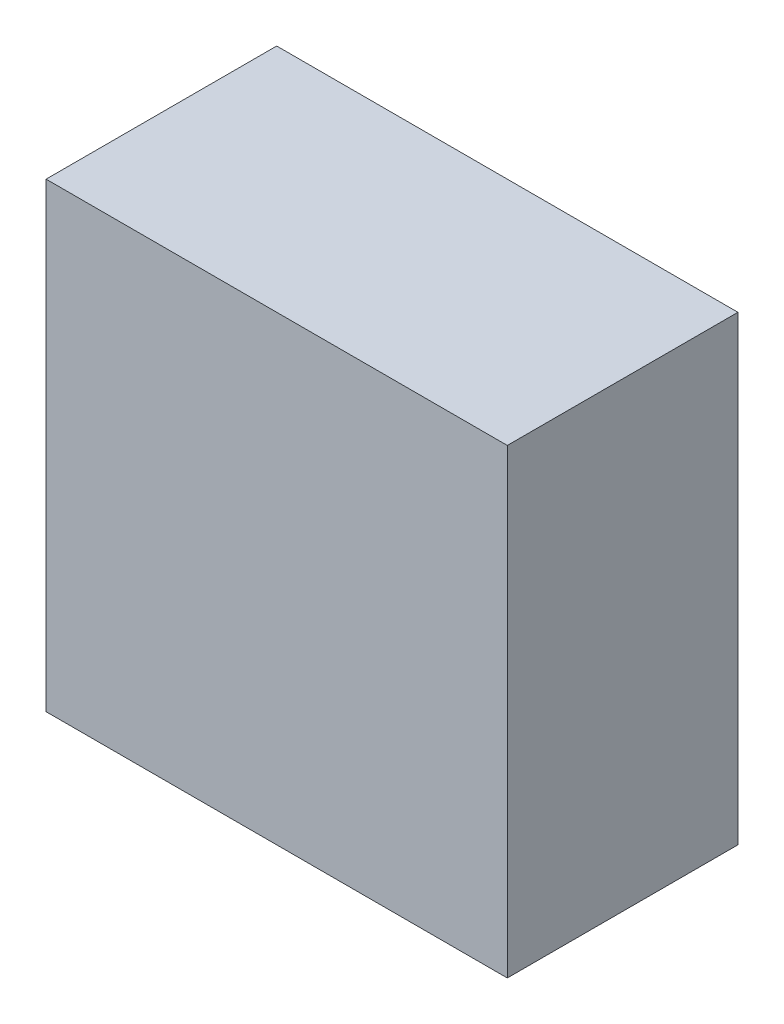
ISO-10303-21;
HEADER;
FILE_DESCRIPTION(('STEP AP214'),'2;1');
FILE_NAME('part.step','',(''),(''),'','','');
FILE_SCHEMA(('AUTOMOTIVE_DESIGN { 1 0 10303 214 1 1 1 1 }'));
ENDSEC;
DATA;
#1=APPLICATION_CONTEXT('core data for automotive mechanical design processes');
#2=APPLICATION_PROTOCOL_DEFINITION('international standard','automotive_design',2000,#1);
#3=PRODUCT_CONTEXT('',#1,'mechanical');
#4=PRODUCT('Part','Part','',(#3));
#5=PRODUCT_RELATED_PRODUCT_CATEGORY('part','',(#4));
#6=PRODUCT_DEFINITION_FORMATION('','',#4);
#7=PRODUCT_DEFINITION_CONTEXT('part definition',#1,'design');
#8=PRODUCT_DEFINITION('design','',#6,#7);
#9=PRODUCT_DEFINITION_SHAPE('','',#8);
#10=(LENGTH_UNIT() NAMED_UNIT(*) SI_UNIT(.MILLI.,.METRE.));
#11=(NAMED_UNIT(*) PLANE_ANGLE_UNIT() SI_UNIT($,.RADIAN.));
#12=(NAMED_UNIT(*) SI_UNIT($,.STERADIAN.) SOLID_ANGLE_UNIT());
#13=UNCERTAINTY_MEASURE_WITH_UNIT(LENGTH_MEASURE(1.E-05),#10,'distance_accuracy_value','');
#14=(GEOMETRIC_REPRESENTATION_CONTEXT(3) GLOBAL_UNCERTAINTY_ASSIGNED_CONTEXT((#13)) GLOBAL_UNIT_ASSIGNED_CONTEXT((#10,
#11,#12)) REPRESENTATION_CONTEXT('',''));
#15=CARTESIAN_POINT('',(0.,0.,0.));
#16=DIRECTION('',(0.,0.,1.));
#17=DIRECTION('',(1.,0.,0.));
#18=AXIS2_PLACEMENT_3D('',#15,#16,#17);
#19=CARTESIAN_POINT('',(0.,0.,2.75));
#20=DIRECTION('',(0.,0.,-1.));
#21=DIRECTION('',(-1.,0.,0.));
#22=AXIS2_PLACEMENT_3D('',#19,#20,#21);
#23=PLANE('',#22);
#24=DIRECTION('',(1.,0.,0.));
#25=VECTOR('',#24,1.);
#26=CARTESIAN_POINT('',(2.00000000000006,165.941489418563,2.75));
#27=LINE('',#26,#25);
#28=CARTESIAN_POINT('',(-1.99999999999995,165.941489418563,2.75));
#29=VERTEX_POINT('',#28);
#30=CARTESIAN_POINT('',(2.00000000000006,165.941489418563,2.75));
#31=VERTEX_POINT('',#30);
#32=EDGE_CURVE('E80',#29,#31,#27,.T.);
#33=ORIENTED_EDGE('',*,*,#32,.T.);
#34=DIRECTION('',(0.,1.,0.));
#35=VECTOR('',#34,1.);
#36=CARTESIAN_POINT('',(2.00000000000006,169.941489418563,2.75));
#37=LINE('',#36,#35);
#38=CARTESIAN_POINT('',(2.00000000000006,169.941489418563,2.75));
#39=VERTEX_POINT('',#38);
#40=EDGE_CURVE('E55',#31,#39,#37,.T.);
#41=ORIENTED_EDGE('',*,*,#40,.T.);
#42=DIRECTION('',(1.,0.,0.));
#43=VECTOR('',#42,1.);
#44=CARTESIAN_POINT('',(2.00000000000006,169.941489418563,2.75));
#45=LINE('',#44,#43);
#46=CARTESIAN_POINT('',(-1.99999999999995,169.941489418563,2.75));
#47=VERTEX_POINT('',#46);
#48=EDGE_CURVE('E57',#39,#47,#45,.F.);
#49=ORIENTED_EDGE('',*,*,#48,.T.);
#50=DIRECTION('',(0.,1.,0.));
#51=VECTOR('',#50,1.);
#52=CARTESIAN_POINT('',(-1.99999999999995,169.941489418563,2.75));
#53=LINE('',#52,#51);
#54=EDGE_CURVE('E20',#47,#29,#53,.F.);
#55=ORIENTED_EDGE('',*,*,#54,.T.);
#56=EDGE_LOOP('',(#33,#41,#49,#55));
#57=FACE_BOUND('',#56,.T.);
#58=ADVANCED_FACE('F17',(#57),#23,.F.);
#59=CARTESIAN_POINT('',(-1.99999999999995,169.941489418563,2.75));
#60=DIRECTION('',(1.,0.,0.));
#61=DIRECTION('',(0.,0.,-1.));
#62=AXIS2_PLACEMENT_3D('',#59,#60,#61);
#63=PLANE('',#62);
#64=DIRECTION('',(0.,0.,1.));
#65=VECTOR('',#64,1.);
#66=CARTESIAN_POINT('',(-1.99999999999995,165.941489418563,2.75));
#67=LINE('',#66,#65);
#68=CARTESIAN_POINT('',(-1.99999999999995,165.941489418563,0.75));
#69=VERTEX_POINT('',#68);
#70=EDGE_CURVE('E68',#69,#29,#67,.T.);
#71=ORIENTED_EDGE('',*,*,#70,.T.);
#72=ORIENTED_EDGE('',*,*,#54,.F.);
#73=DIRECTION('',(0.,0.,-1.));
#74=VECTOR('',#73,1.);
#75=CARTESIAN_POINT('',(-1.99999999999995,169.941489418563,2.75));
#76=LINE('',#75,#74);
#77=CARTESIAN_POINT('',(-1.99999999999995,169.941489418563,0.75));
#78=VERTEX_POINT('',#77);
#79=EDGE_CURVE('E63',#47,#78,#76,.T.);
#80=ORIENTED_EDGE('',*,*,#79,.T.);
#81=DIRECTION('',(0.,1.,0.));
#82=VECTOR('',#81,1.);
#83=CARTESIAN_POINT('',(-1.99999999999995,0.,0.75));
#84=LINE('',#83,#82);
#85=EDGE_CURVE('E83',#69,#78,#84,.T.);
#86=ORIENTED_EDGE('',*,*,#85,.F.);
#87=EDGE_LOOP('',(#71,#72,#80,#86));
#88=FACE_BOUND('',#87,.T.);
#89=ADVANCED_FACE('F65',(#88),#63,.F.);
#90=CARTESIAN_POINT('',(2.00000000000006,169.941489418563,2.75));
#91=DIRECTION('',(0.,-1.,0.));
#92=DIRECTION('',(0.,0.,-1.));
#93=AXIS2_PLACEMENT_3D('',#90,#91,#92);
#94=PLANE('',#93);
#95=ORIENTED_EDGE('',*,*,#79,.F.);
#96=ORIENTED_EDGE('',*,*,#48,.F.);
#97=DIRECTION('',(0.,0.,1.));
#98=VECTOR('',#97,1.);
#99=CARTESIAN_POINT('',(2.00000000000006,169.941489418563,2.75));
#100=LINE('',#99,#98);
#101=CARTESIAN_POINT('',(2.00000000000006,169.941489418563,0.75));
#102=VERTEX_POINT('',#101);
#103=EDGE_CURVE('E75',#39,#102,#100,.F.);
#104=ORIENTED_EDGE('',*,*,#103,.T.);
#105=DIRECTION('',(-1.,0.,0.));
#106=VECTOR('',#105,1.);
#107=CARTESIAN_POINT('',(0.,169.941489418563,0.75));
#108=LINE('',#107,#106);
#109=EDGE_CURVE('E72',#78,#102,#108,.F.);
#110=ORIENTED_EDGE('',*,*,#109,.F.);
#111=EDGE_LOOP('',(#95,#96,#104,#110));
#112=FACE_BOUND('',#111,.T.);
#113=ADVANCED_FACE('F70',(#112),#94,.F.);
#114=CARTESIAN_POINT('',(2.00000000000006,169.941489418563,2.75));
#115=DIRECTION('',(-1.,0.,0.));
#116=DIRECTION('',(0.,0.,1.));
#117=AXIS2_PLACEMENT_3D('',#114,#115,#116);
#118=PLANE('',#117);
#119=ORIENTED_EDGE('',*,*,#103,.F.);
#120=ORIENTED_EDGE('',*,*,#40,.F.);
#121=DIRECTION('',(0.,0.,1.));
#122=VECTOR('',#121,1.);
#123=CARTESIAN_POINT('',(2.00000000000006,165.941489418563,2.75));
#124=LINE('',#123,#122);
#125=CARTESIAN_POINT('',(2.00000000000006,165.941489418563,0.75));
#126=VERTEX_POINT('',#125);
#127=EDGE_CURVE('E35',#31,#126,#124,.F.);
#128=ORIENTED_EDGE('',*,*,#127,.T.);
#129=DIRECTION('',(0.,1.,0.));
#130=VECTOR('',#129,1.);
#131=CARTESIAN_POINT('',(2.00000000000006,0.,0.75));
#132=LINE('',#131,#130);
#133=EDGE_CURVE('E26',#102,#126,#132,.F.);
#134=ORIENTED_EDGE('',*,*,#133,.F.);
#135=EDGE_LOOP('',(#119,#120,#128,#134));
#136=FACE_BOUND('',#135,.T.);
#137=ADVANCED_FACE('F89',(#136),#118,.F.);
#138=CARTESIAN_POINT('',(2.00000000000006,165.941489418563,2.75));
#139=DIRECTION('',(0.,1.,0.));
#140=DIRECTION('',(0.,0.,1.));
#141=AXIS2_PLACEMENT_3D('',#138,#139,#140);
#142=PLANE('',#141);
#143=ORIENTED_EDGE('',*,*,#127,.F.);
#144=ORIENTED_EDGE('',*,*,#32,.F.);
#145=ORIENTED_EDGE('',*,*,#70,.F.);
#146=DIRECTION('',(-1.,0.,0.));
#147=VECTOR('',#146,1.);
#148=CARTESIAN_POINT('',(0.,165.941489418563,0.75));
#149=LINE('',#148,#147);
#150=EDGE_CURVE('E11',#126,#69,#149,.T.);
#151=ORIENTED_EDGE('',*,*,#150,.F.);
#152=EDGE_LOOP('',(#143,#144,#145,#151));
#153=FACE_BOUND('',#152,.T.);
#154=ADVANCED_FACE('F91',(#153),#142,.F.);
#155=CARTESIAN_POINT('',(0.,0.,0.75));
#156=DIRECTION('',(0.,0.,-1.));
#157=DIRECTION('',(-1.,0.,0.));
#158=AXIS2_PLACEMENT_3D('',#155,#156,#157);
#159=PLANE('',#158);
#160=ORIENTED_EDGE('',*,*,#133,.T.);
#161=ORIENTED_EDGE('',*,*,#150,.T.);
#162=ORIENTED_EDGE('',*,*,#85,.T.);
#163=ORIENTED_EDGE('',*,*,#109,.T.);
#164=EDGE_LOOP('',(#160,#161,#162,#163));
#165=FACE_BOUND('',#164,.T.);
#166=ADVANCED_FACE('F88',(#165),#159,.T.);
#167=CLOSED_SHELL('',(#58,#89,#113,#137,#154,#166));
#168=MANIFOLD_SOLID_BREP('B1',#167);
#169=ADVANCED_BREP_SHAPE_REPRESENTATION('',(#18,#168),#14);
#170=SHAPE_DEFINITION_REPRESENTATION(#9,#169);
ENDSEC;
END-ISO-10303-21;
